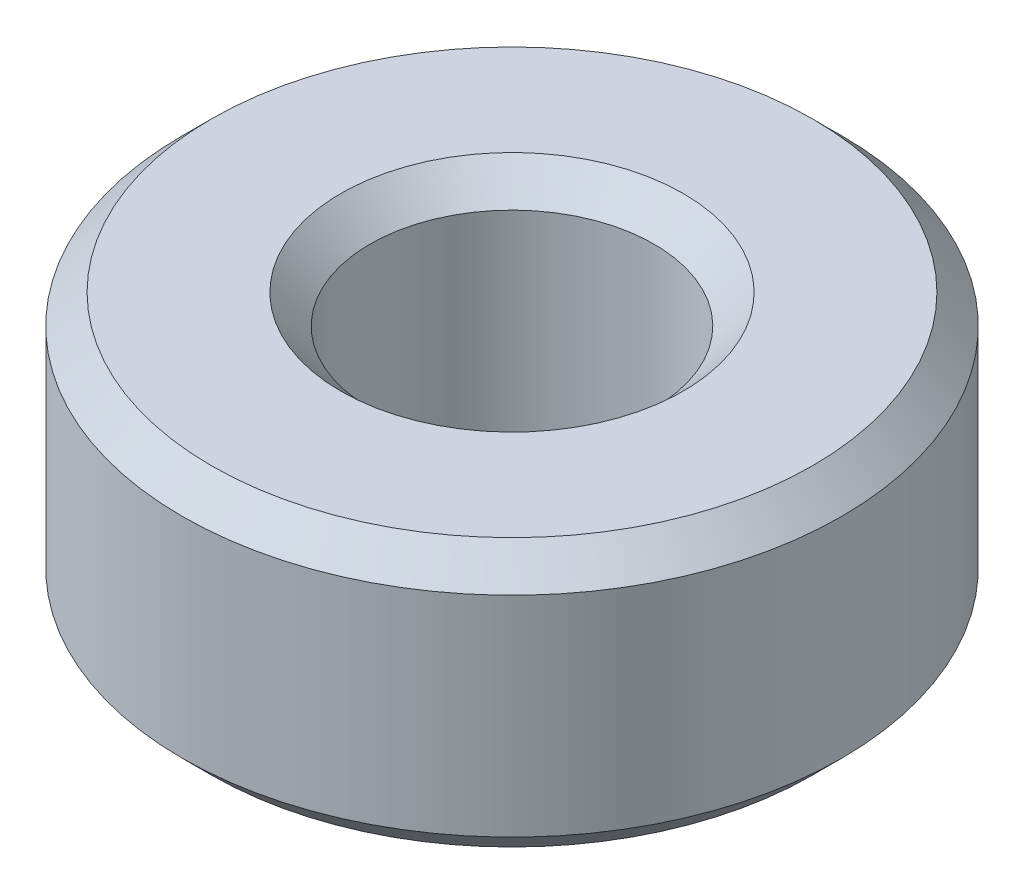
ISO-10303-21;
HEADER;
FILE_DESCRIPTION(('STEP AP214'),'2;1');
FILE_NAME('part.step','',(''),(''),'','','');
FILE_SCHEMA(('AUTOMOTIVE_DESIGN { 1 0 10303 214 1 1 1 1 }'));
ENDSEC;
DATA;
#1=APPLICATION_CONTEXT('core data for automotive mechanical design processes');
#2=APPLICATION_PROTOCOL_DEFINITION('international standard','automotive_design',2000,#1);
#3=PRODUCT_CONTEXT('',#1,'mechanical');
#4=PRODUCT('Part','Part','',(#3));
#5=PRODUCT_RELATED_PRODUCT_CATEGORY('part','',(#4));
#6=PRODUCT_DEFINITION_FORMATION('','',#4);
#7=PRODUCT_DEFINITION_CONTEXT('part definition',#1,'design');
#8=PRODUCT_DEFINITION('design','',#6,#7);
#9=PRODUCT_DEFINITION_SHAPE('','',#8);
#10=(LENGTH_UNIT() NAMED_UNIT(*) SI_UNIT(.MILLI.,.METRE.));
#11=(NAMED_UNIT(*) PLANE_ANGLE_UNIT() SI_UNIT($,.RADIAN.));
#12=(NAMED_UNIT(*) SI_UNIT($,.STERADIAN.) SOLID_ANGLE_UNIT());
#13=UNCERTAINTY_MEASURE_WITH_UNIT(LENGTH_MEASURE(1.E-05),#10,'distance_accuracy_value','');
#14=(GEOMETRIC_REPRESENTATION_CONTEXT(3) GLOBAL_UNCERTAINTY_ASSIGNED_CONTEXT((#13)) GLOBAL_UNIT_ASSIGNED_CONTEXT((#10,
#11,#12)) REPRESENTATION_CONTEXT('',''));
#15=CARTESIAN_POINT('',(0.,0.,0.));
#16=DIRECTION('',(0.,0.,1.));
#17=DIRECTION('',(1.,0.,0.));
#18=AXIS2_PLACEMENT_3D('',#15,#16,#17);
#19=CARTESIAN_POINT('',(0.,32.5057227409581,0.));
#20=DIRECTION('',(0.,-1.,0.));
#21=DIRECTION('',(0.,0.,-1.));
#22=AXIS2_PLACEMENT_3D('',#19,#20,#21);
#23=CYLINDRICAL_SURFACE('',#22,40.);
#24=CARTESIAN_POINT('',(0.,3.54488084202711,0.));
#25=DIRECTION('',(0.,1.,0.));
#26=DIRECTION('',(0.,0.,1.));
#27=AXIS2_PLACEMENT_3D('',#24,#25,#26);
#28=CIRCLE('',#27,40.);
#29=CARTESIAN_POINT('',(0.,3.54488084202711,40.));
#30=VERTEX_POINT('',#29);
#31=EDGE_CURVE('E10',#30,#30,#28,.T.);
#32=ORIENTED_EDGE('',*,*,#31,.T.);
#33=EDGE_LOOP('',(#32));
#34=FACE_BOUND('',#33,.T.);
#35=CARTESIAN_POINT('',(0.,28.960841898931,0.));
#36=DIRECTION('',(0.,1.,0.));
#37=DIRECTION('',(0.,0.,1.));
#38=AXIS2_PLACEMENT_3D('',#35,#36,#37);
#39=CIRCLE('',#38,40.);
#40=CARTESIAN_POINT('',(0.,28.960841898931,40.));
#41=VERTEX_POINT('',#40);
#42=EDGE_CURVE('E50',#41,#41,#39,.F.);
#43=ORIENTED_EDGE('',*,*,#42,.T.);
#44=EDGE_LOOP('',(#43));
#45=FACE_BOUND('',#44,.T.);
#46=ADVANCED_FACE('F39',(#34,#45),#23,.T.);
#47=CARTESIAN_POINT('',(0.,32.5057227409581,0.));
#48=DIRECTION('',(0.,1.,0.));
#49=DIRECTION('',(0.,0.,1.));
#50=AXIS2_PLACEMENT_3D('',#47,#48,#49);
#51=PLANE('',#50);
#52=CARTESIAN_POINT('',(0.,32.5057227409581,0.));
#53=DIRECTION('',(0.,1.,0.));
#54=DIRECTION('',(0.,0.,1.));
#55=AXIS2_PLACEMENT_3D('',#52,#53,#54);
#56=CIRCLE('',#55,20.7736215587049);
#57=CARTESIAN_POINT('',(0.,32.5057227409581,20.7736215587049));
#58=VERTEX_POINT('',#57);
#59=EDGE_CURVE('E58',#58,#58,#56,.F.);
#60=ORIENTED_EDGE('',*,*,#59,.T.);
#61=EDGE_LOOP('',(#60));
#62=FACE_BOUND('',#61,.T.);
#63=CARTESIAN_POINT('',(0.,32.5057227409581,0.));
#64=DIRECTION('',(0.,1.,0.));
#65=DIRECTION('',(0.,0.,1.));
#66=AXIS2_PLACEMENT_3D('',#63,#64,#65);
#67=CIRCLE('',#66,36.4551191579729);
#68=CARTESIAN_POINT('',(0.,32.5057227409581,36.4551191579729));
#69=VERTEX_POINT('',#68);
#70=EDGE_CURVE('E61',#69,#69,#67,.T.);
#71=ORIENTED_EDGE('',*,*,#70,.T.);
#72=EDGE_LOOP('',(#71));
#73=FACE_BOUND('',#72,.T.);
#74=ADVANCED_FACE('F88',(#62,#73),#51,.T.);
#75=CARTESIAN_POINT('',(0.,0.,0.));
#76=DIRECTION('',(0.,1.,0.));
#77=DIRECTION('',(0.,0.,1.));
#78=AXIS2_PLACEMENT_3D('',#75,#76,#77);
#79=PLANE('',#78);
#80=CARTESIAN_POINT('',(0.,0.,0.));
#81=DIRECTION('',(0.,1.,0.));
#82=DIRECTION('',(0.,0.,1.));
#83=AXIS2_PLACEMENT_3D('',#80,#81,#82);
#84=CIRCLE('',#83,20.7736215587049);
#85=CARTESIAN_POINT('',(0.,0.,20.7736215587049));
#86=VERTEX_POINT('',#85);
#87=EDGE_CURVE('E51',#86,#86,#84,.T.);
#88=ORIENTED_EDGE('',*,*,#87,.T.);
#89=EDGE_LOOP('',(#88));
#90=FACE_BOUND('',#89,.T.);
#91=CARTESIAN_POINT('',(0.,0.,0.));
#92=DIRECTION('',(0.,1.,0.));
#93=DIRECTION('',(0.,0.,1.));
#94=AXIS2_PLACEMENT_3D('',#91,#92,#93);
#95=CIRCLE('',#94,36.4551191579729);
#96=CARTESIAN_POINT('',(0.,0.,36.4551191579729));
#97=VERTEX_POINT('',#96);
#98=EDGE_CURVE('E54',#97,#97,#95,.F.);
#99=ORIENTED_EDGE('',*,*,#98,.T.);
#100=EDGE_LOOP('',(#99));
#101=FACE_BOUND('',#100,.T.);
#102=ADVANCED_FACE('F83',(#90,#101),#79,.F.);
#103=CARTESIAN_POINT('',(0.,32.5057227409581,0.));
#104=DIRECTION('',(0.,-1.,0.));
#105=DIRECTION('',(0.,0.,-1.));
#106=AXIS2_PLACEMENT_3D('',#103,#104,#105);
#107=CYLINDRICAL_SURFACE('',#106,17.2287407166777);
#108=CARTESIAN_POINT('',(0.,28.960841898931,0.));
#109=DIRECTION('',(0.,1.,0.));
#110=DIRECTION('',(0.,0.,1.));
#111=AXIS2_PLACEMENT_3D('',#108,#109,#110);
#112=CIRCLE('',#111,17.2287407166777);
#113=CARTESIAN_POINT('',(0.,28.960841898931,17.2287407166777));
#114=VERTEX_POINT('',#113);
#115=EDGE_CURVE('E67',#114,#114,#112,.T.);
#116=ORIENTED_EDGE('',*,*,#115,.T.);
#117=EDGE_LOOP('',(#116));
#118=FACE_BOUND('',#117,.T.);
#119=CARTESIAN_POINT('',(0.,3.54488084202714,0.));
#120=DIRECTION('',(0.,1.,0.));
#121=DIRECTION('',(0.,0.,1.));
#122=AXIS2_PLACEMENT_3D('',#119,#120,#121);
#123=CIRCLE('',#122,17.2287407166777);
#124=CARTESIAN_POINT('',(0.,3.54488084202714,17.2287407166777));
#125=VERTEX_POINT('',#124);
#126=EDGE_CURVE('E69',#125,#125,#123,.F.);
#127=ORIENTED_EDGE('',*,*,#126,.T.);
#128=EDGE_LOOP('',(#127));
#129=FACE_BOUND('',#128,.T.);
#130=ADVANCED_FACE('F71',(#118,#129),#107,.F.);
#131=CARTESIAN_POINT('',(0.,28.960841898931,0.));
#132=DIRECTION('',(0.,1.,0.));
#133=DIRECTION('',(0.,0.,1.));
#134=AXIS2_PLACEMENT_3D('',#131,#132,#133);
#135=CONICAL_SURFACE('',#134,17.2287407166777,0.785398163397453);
#136=CARTESIAN_POINT('',(0.,32.5057227409581,20.7736215587049));
#137=CARTESIAN_POINT('',(0.,32.4687968988536,20.7366957166004));
#138=CARTESIAN_POINT('',(0.,32.4318710567492,20.699769874496));
#139=CARTESIAN_POINT('',(0.,32.3580193725403,20.6259181902871));
#140=CARTESIAN_POINT('',(0.,32.3210935304358,20.5889923481826));
#141=CARTESIAN_POINT('',(0.,32.2472418462269,20.5151406639737));
#142=CARTESIAN_POINT('',(0.,32.2103160041225,20.4782148218693));
#143=CARTESIAN_POINT('',(0.,32.1364643199136,20.4043631376604));
#144=CARTESIAN_POINT('',(0.,32.0995384778091,20.3674372955559));
#145=CARTESIAN_POINT('',(0.,32.0256867936002,20.293585611347));
#146=CARTESIAN_POINT('',(0.,31.9887609514958,20.2566597692426));
#147=CARTESIAN_POINT('',(0.,31.9149092672869,20.1828080850337));
#148=CARTESIAN_POINT('',(0.,31.8779834251824,20.1458822429292));
#149=CARTESIAN_POINT('',(0.,31.8041317409736,20.0720305587203));
#150=CARTESIAN_POINT('',(0.,31.7672058988691,20.0351047166159));
#151=CARTESIAN_POINT('',(0.,31.6933542146602,19.961253032407));
#152=CARTESIAN_POINT('',(0.,31.6564283725558,19.9243271903025));
#153=CARTESIAN_POINT('',(0.,31.5825766883469,19.8504755060936));
#154=CARTESIAN_POINT('',(0.,31.5456508462424,19.8135496639892));
#155=CARTESIAN_POINT('',(0.,31.4717991620335,19.7396979797803));
#156=CARTESIAN_POINT('',(0.,31.4348733199291,19.7027721376758));
#157=CARTESIAN_POINT('',(0.,31.3610216357202,19.6289204534669));
#158=CARTESIAN_POINT('',(0.,31.3240957936157,19.5919946113625));
#159=CARTESIAN_POINT('',(0.,31.2502441094068,19.5181429271536));
#160=CARTESIAN_POINT('',(0.,31.2133182673024,19.4812170850491));
#161=CARTESIAN_POINT('',(0.,31.1394665830935,19.4073654008402));
#162=CARTESIAN_POINT('',(0.,31.102540740989,19.3704395587358));
#163=CARTESIAN_POINT('',(0.,31.0286890567801,19.2965878745269));
#164=CARTESIAN_POINT('',(0.,30.9917632146757,19.2596620324224));
#165=CARTESIAN_POINT('',(0.,30.9179115304668,19.1858103482136));
#166=CARTESIAN_POINT('',(0.,30.8809856883623,19.1488845061091));
#167=CARTESIAN_POINT('',(0.,30.8071340041534,19.0750328219002));
#168=CARTESIAN_POINT('',(0.,30.770208162049,19.0381069797957));
#169=CARTESIAN_POINT('',(0.,30.6963564778401,18.9642552955869));
#170=CARTESIAN_POINT('',(0.,30.6594306357356,18.9273294534824));
#171=CARTESIAN_POINT('',(0.,30.5855789515267,18.8534777692735));
#172=CARTESIAN_POINT('',(0.,30.5486531094223,18.8165519271691));
#173=CARTESIAN_POINT('',(0.,30.4748014252134,18.7427002429602));
#174=CARTESIAN_POINT('',(0.,30.4378755831089,18.7057744008557));
#175=CARTESIAN_POINT('',(0.,30.3640238989,18.6319227166468));
#176=CARTESIAN_POINT('',(0.,30.3270980567956,18.5949968745424));
#177=CARTESIAN_POINT('',(0.,30.2532463725867,18.5211451903335));
#178=CARTESIAN_POINT('',(0.,30.2163205304822,18.484219348229));
#179=CARTESIAN_POINT('',(0.,30.1424688462733,18.4103676640201));
#180=CARTESIAN_POINT('',(0.,30.1055430041689,18.3734418219157));
#181=CARTESIAN_POINT('',(0.,30.03169131996,18.2995901377068));
#182=CARTESIAN_POINT('',(0.,29.9947654778555,18.2626642956023));
#183=CARTESIAN_POINT('',(0.,29.9209137936466,18.1888126113934));
#184=CARTESIAN_POINT('',(0.,29.8839879515422,18.151886769289));
#185=CARTESIAN_POINT('',(0.,29.8101362673333,18.0780350850801));
#186=CARTESIAN_POINT('',(0.,29.7732104252288,18.0411092429756));
#187=CARTESIAN_POINT('',(0.,29.6993587410199,17.9672575587667));
#188=CARTESIAN_POINT('',(0.,29.6624328989155,17.9303317166623));
#189=CARTESIAN_POINT('',(0.,29.5885812147066,17.8564800324534));
#190=CARTESIAN_POINT('',(0.,29.5516553726022,17.8195541903489));
#191=CARTESIAN_POINT('',(0.,29.4778036883933,17.74570250614));
#192=CARTESIAN_POINT('',(0.,29.4408778462888,17.7087766640356));
#193=CARTESIAN_POINT('',(0.,29.3670261620799,17.6349249798267));
#194=CARTESIAN_POINT('',(0.,29.3301003199755,17.5979991377222));
#195=CARTESIAN_POINT('',(0.,29.2562486357666,17.5241474535133));
#196=CARTESIAN_POINT('',(0.,29.2193227936621,17.4872216114089));
#197=CARTESIAN_POINT('',(0.,29.1454711094532,17.4133699272));
#198=CARTESIAN_POINT('',(0.,29.1085452673488,17.3764440850955));
#199=CARTESIAN_POINT('',(0.,29.0346935831399,17.3025924008866));
#200=CARTESIAN_POINT('',(0.,28.9977677410354,17.2656665587822));
#201=CARTESIAN_POINT('',(0.,28.960841898931,17.2287407166777));
#202=B_SPLINE_CURVE_WITH_KNOTS('',3,(#136,#137,#138,#139,#140,#141,#142,#143,#144,#145,#146,
#147,#148,#149,#150,#151,#152,#153,#154,#155,#156,#157,#158,#159,#160,#161,#162,#163,#164,#165,
#166,#167,#168,#169,#170,#171,#172,#173,#174,#175,#176,#177,#178,#179,#180,#181,#182,#183,#184,
#185,#186,#187,#188,#189,#190,#191,#192,#193,#194,#195,#196,#197,#198,#199,#200,#201),
.UNSPECIFIED.,.F.,.F.,(4,2,2,2,2,2,2,2,2,2,2,2,2,2,2,2,2,2,2,2,2,2,2,2,2,2,2,2,2,2,2,2,4),(0.,
0.156663080118479,0.313326160236956,0.469989240355433,0.626652320473913,0.783315400592392,
0.939978480710869,1.09664156082935,1.25330464094783,1.40996772106631,1.56663080118479,
1.72329388130327,1.87995696142175,2.03662004154023,2.1932831216587,2.34994620177718,
2.50660928189566,2.66327236201414,2.81993544213262,2.9765985222511,3.13326160236958,
3.28992468248806,3.44658776260654,3.60325084272502,3.75991392284349,3.91657700296197,
4.07324008308045,4.22990316319893,4.38656624331741,4.54322932343589,4.69989240355437,
4.85655548367285,5.01321856379132),.UNSPECIFIED.);
#203=EDGE_CURVE('BSEAM77',#58,#114,#202,.T.);
#204=ORIENTED_EDGE('',*,*,#59,.F.);
#205=ORIENTED_EDGE('',*,*,#115,.F.);
#206=ORIENTED_EDGE('',*,*,#203,.T.);
#207=ORIENTED_EDGE('',*,*,#203,.F.);
#208=EDGE_LOOP('',(#204,#206,#205,#207));
#209=FACE_BOUND('',#208,.T.);
#210=ADVANCED_FACE('F77',(#209),#135,.F.);
#211=CARTESIAN_POINT('',(0.,0.,0.));
#212=DIRECTION('',(0.,-1.,0.));
#213=DIRECTION('',(0.,0.,-1.));
#214=AXIS2_PLACEMENT_3D('',#211,#212,#213);
#215=CONICAL_SURFACE('',#214,20.7736215587049,0.785398163397446);
#216=ORIENTED_EDGE('',*,*,#126,.F.);
#217=EDGE_LOOP('',(#216));
#218=FACE_BOUND('',#217,.T.);
#219=ORIENTED_EDGE('',*,*,#87,.F.);
#220=EDGE_LOOP('',(#219));
#221=FACE_BOUND('',#220,.T.);
#222=ADVANCED_FACE('F73',(#218,#221),#215,.F.);
#223=CARTESIAN_POINT('',(0.,3.54488084202711,0.));
#224=DIRECTION('',(0.,1.,0.));
#225=DIRECTION('',(0.,0.,1.));
#226=AXIS2_PLACEMENT_3D('',#223,#224,#225);
#227=CONICAL_SURFACE('',#226,40.,0.785398163397452);
#228=ORIENTED_EDGE('',*,*,#98,.F.);
#229=EDGE_LOOP('',(#228));
#230=FACE_BOUND('',#229,.T.);
#231=ORIENTED_EDGE('',*,*,#31,.F.);
#232=EDGE_LOOP('',(#231));
#233=FACE_BOUND('',#232,.T.);
#234=ADVANCED_FACE('F76',(#230,#233),#227,.T.);
#235=CARTESIAN_POINT('',(0.,32.5057227409581,0.));
#236=DIRECTION('',(0.,-1.,0.));
#237=DIRECTION('',(0.,0.,-1.));
#238=AXIS2_PLACEMENT_3D('',#235,#236,#237);
#239=CONICAL_SURFACE('',#238,36.4551191579729,0.785398163397445);
#240=ORIENTED_EDGE('',*,*,#42,.F.);
#241=EDGE_LOOP('',(#240));
#242=FACE_BOUND('',#241,.T.);
#243=ORIENTED_EDGE('',*,*,#70,.F.);
#244=EDGE_LOOP('',(#243));
#245=FACE_BOUND('',#244,.T.);
#246=ADVANCED_FACE('F45',(#242,#245),#239,.T.);
#247=CLOSED_SHELL('',(#46,#74,#102,#130,#210,#222,#234,#246));
#248=MANIFOLD_SOLID_BREP('B2',#247);
#249=ADVANCED_BREP_SHAPE_REPRESENTATION('',(#18,#248),#14);
#250=SHAPE_DEFINITION_REPRESENTATION(#9,#249);
ENDSEC;
END-ISO-10303-21;
